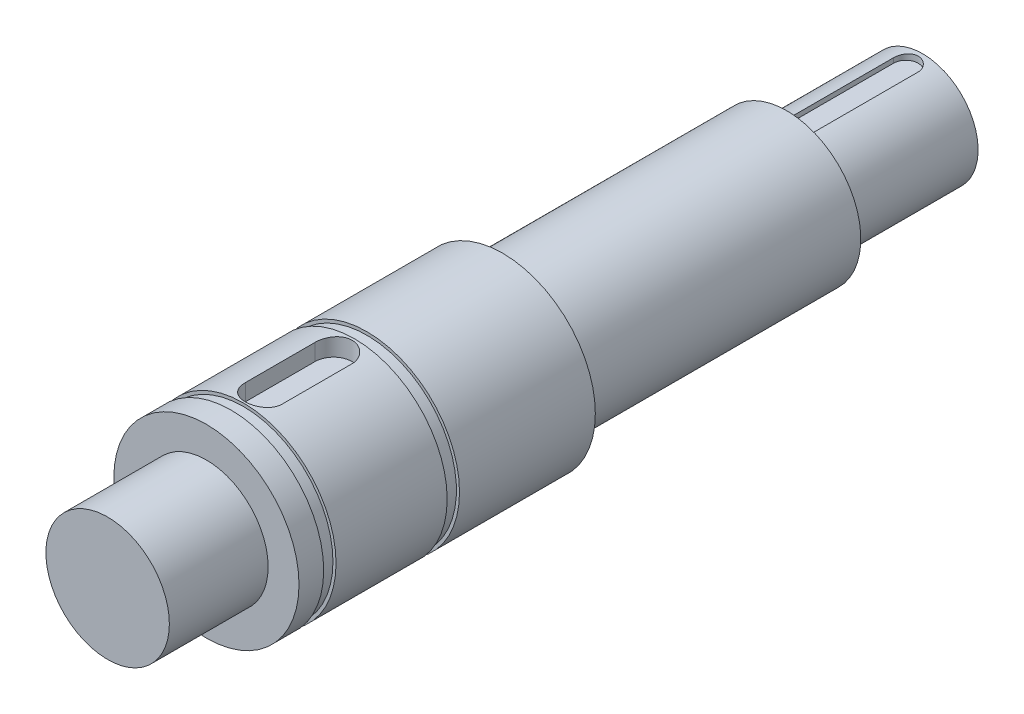
ISO-10303-21;
HEADER;
FILE_DESCRIPTION(('STEP AP214'),'2;1');
FILE_NAME('part.step','',(''),(''),'','','');
FILE_SCHEMA(('AUTOMOTIVE_DESIGN { 1 0 10303 214 1 1 1 1 }'));
ENDSEC;
DATA;
#1=APPLICATION_CONTEXT('core data for automotive mechanical design processes');
#2=APPLICATION_PROTOCOL_DEFINITION('international standard','automotive_design',2000,#1);
#3=PRODUCT_CONTEXT('',#1,'mechanical');
#4=PRODUCT('Part','Part','',(#3));
#5=PRODUCT_RELATED_PRODUCT_CATEGORY('part','',(#4));
#6=PRODUCT_DEFINITION_FORMATION('','',#4);
#7=PRODUCT_DEFINITION_CONTEXT('part definition',#1,'design');
#8=PRODUCT_DEFINITION('design','',#6,#7);
#9=PRODUCT_DEFINITION_SHAPE('','',#8);
#10=(LENGTH_UNIT() NAMED_UNIT(*) SI_UNIT(.MILLI.,.METRE.));
#11=(NAMED_UNIT(*) PLANE_ANGLE_UNIT() SI_UNIT($,.RADIAN.));
#12=(NAMED_UNIT(*) SI_UNIT($,.STERADIAN.) SOLID_ANGLE_UNIT());
#13=UNCERTAINTY_MEASURE_WITH_UNIT(LENGTH_MEASURE(1.E-05),#10,'distance_accuracy_value','');
#14=(GEOMETRIC_REPRESENTATION_CONTEXT(3) GLOBAL_UNCERTAINTY_ASSIGNED_CONTEXT((#13)) GLOBAL_UNIT_ASSIGNED_CONTEXT((#10,
#11,#12)) REPRESENTATION_CONTEXT('',''));
#15=CARTESIAN_POINT('',(0.,0.,0.));
#16=DIRECTION('',(0.,0.,1.));
#17=DIRECTION('',(1.,0.,0.));
#18=AXIS2_PLACEMENT_3D('',#15,#16,#17);
#19=CARTESIAN_POINT('',(0.,0.,-58.));
#20=DIRECTION('',(0.,0.,1.));
#21=DIRECTION('',(1.,0.,0.));
#22=AXIS2_PLACEMENT_3D('',#19,#20,#21);
#23=CYLINDRICAL_SURFACE('',#22,4.5);
#24=CARTESIAN_POINT('',(0.,0.,-47.));
#25=DIRECTION('',(0.,0.,-1.));
#26=DIRECTION('',(-1.,0.,0.));
#27=AXIS2_PLACEMENT_3D('',#24,#25,#26);
#28=CIRCLE('',#27,4.5);
#29=CARTESIAN_POINT('',(-4.5,0.,-47.));
#30=VERTEX_POINT('',#29);
#31=EDGE_CURVE('E168',#30,#30,#28,.T.);
#32=ORIENTED_EDGE('',*,*,#31,.T.);
#33=EDGE_LOOP('',(#32));
#34=FACE_BOUND('',#33,.T.);
#35=CARTESIAN_POINT('',(0.,0.,-58.));
#36=DIRECTION('',(0.,0.,-1.));
#37=DIRECTION('',(-1.,0.,0.));
#38=AXIS2_PLACEMENT_3D('',#35,#36,#37);
#39=CIRCLE('',#38,4.5);
#40=CARTESIAN_POINT('',(-4.5,0.,-58.));
#41=VERTEX_POINT('',#40);
#42=EDGE_CURVE('E169',#41,#41,#39,.T.);
#43=ORIENTED_EDGE('',*,*,#42,.F.);
#44=EDGE_LOOP('',(#43));
#45=FACE_BOUND('',#44,.T.);
#46=CARTESIAN_POINT('',(-1.,4.38748219369606,-48.15));
#47=CARTESIAN_POINT('',(-1.00000022729756,4.38748057820017,-48.1222374267632));
#48=CARTESIAN_POINT('',(-0.998843124720514,4.38774603792456,-48.0944885076275));
#49=CARTESIAN_POINT('',(-0.99422968705631,4.38879432652499,-48.0391962291098));
#50=CARTESIAN_POINT('',(-0.990773678717657,4.38957708187657,-48.0116528410778));
#51=CARTESIAN_POINT('',(-0.977003810088016,4.39267087860999,-47.9297284679647));
#52=CARTESIAN_POINT('',(-0.963287918104315,4.39572762287051,-47.8759073176507));
#53=CARTESIAN_POINT('',(-0.927214454041531,4.40347693098967,-47.77140532904));
#54=CARTESIAN_POINT('',(-0.904856659920317,4.40816953687928,-47.7207245714702));
#55=CARTESIAN_POINT('',(-0.852155803282729,4.41865929364095,-47.6238136533554));
#56=CARTESIAN_POINT('',(-0.821811362459797,4.42445663511658,-47.5775842628938));
#57=CARTESIAN_POINT('',(-0.753441836232103,4.43661426749371,-47.4901097244178));
#58=CARTESIAN_POINT('',(-0.715304798206198,4.44298190226389,-47.4489531224835));
#59=CARTESIAN_POINT('',(-0.632670298583493,4.45549904324729,-47.3735614669263));
#60=CARTESIAN_POINT('',(-0.588171842200236,4.46164851515653,-47.339327497877));
#61=CARTESIAN_POINT('',(-0.493480718999464,4.4731166145963,-47.2784037682988));
#62=CARTESIAN_POINT('',(-0.443231466972286,4.47842549507079,-47.2517999652732));
#63=CARTESIAN_POINT('',(-0.3388403259969,4.48753032196369,-47.2074491795047));
#64=CARTESIAN_POINT('',(-0.284699093445023,4.49132652279754,-47.1897007072694));
#65=CARTESIAN_POINT('',(-0.174986021353863,4.49692639035223,-47.1638434270851));
#66=CARTESIAN_POINT('',(-0.119451384668941,4.49876123301171,-47.1555836324999));
#67=CARTESIAN_POINT('',(-0.00775511274977182,4.50033975027167,-47.1484658402696));
#68=CARTESIAN_POINT('',(0.0484064623138786,4.50008362385938,-47.149606947987));
#69=CARTESIAN_POINT('',(0.158718181022166,4.49753274170445,-47.1611468829189));
#70=CARTESIAN_POINT('',(0.212886328087554,4.49527387966133,-47.1713827182866));
#71=CARTESIAN_POINT('',(0.318715838159109,4.48901235449708,-47.2005614897614));
#72=CARTESIAN_POINT('',(0.370377105463963,4.48500962486109,-47.2195047579901));
#73=CARTESIAN_POINT('',(0.47017759722058,4.4756526258873,-47.2657038028141));
#74=CARTESIAN_POINT('',(0.518287379800331,4.47028840892171,-47.2930210829071));
#75=CARTESIAN_POINT('',(0.609297798291436,4.45879618403283,-47.3551460967624));
#76=CARTESIAN_POINT('',(0.6521978506051,4.4526680906951,-47.389954668496));
#77=CARTESIAN_POINT('',(0.732537514994336,4.44016659933762,-47.4669551250524));
#78=CARTESIAN_POINT('',(0.769840928924182,4.43379075752742,-47.5092888279695));
#79=CARTESIAN_POINT('',(0.836854255104539,4.42163303741232,-47.5996903555232));
#80=CARTESIAN_POINT('',(0.866562088463182,4.41585132197676,-47.6477597447345));
#81=CARTESIAN_POINT('',(0.91760572203866,4.40552868647316,-47.7485006469476));
#82=CARTESIAN_POINT('',(0.938910270762524,4.40099241682023,-47.8011884646172));
#83=CARTESIAN_POINT('',(0.972293085974258,4.39373905796516,-47.9094884021323));
#84=CARTESIAN_POINT('',(0.984385094390385,4.39101925996541,-47.965096033648));
#85=CARTESIAN_POINT('',(0.994454316918768,4.38874305217374,-48.0426368683371));
#86=CARTESIAN_POINT('',(0.996534530294847,4.38827083327373,-48.0640724361361));
#87=CARTESIAN_POINT('',(0.999305697460971,4.38764061776731,-48.1070020407818));
#88=CARTESIAN_POINT('',(0.99999895320797,4.38748210050975,-48.1284959213596));
#89=CARTESIAN_POINT('',(1.,4.38748219369606,-48.15));
#90=B_SPLINE_CURVE_WITH_KNOTS('',3,(#46,#47,#48,#49,#50,#51,#52,#53,#54,#55,#56,#57,#58,#59,#60,
#61,#62,#63,#64,#65,#66,#67,#68,#69,#70,#71,#72,#73,#74,#75,#76,#77,#78,#79,#80,#81,#82,#83,#84,
#85,#86,#87,#88,#89),.UNSPECIFIED.,.F.,.F.,(4,2,2,2,2,2,2,2,2,2,2,2,2,2,2,2,2,2,2,2,2,4),(0.,
0.0832354312787237,0.166459034650705,0.332474058250131,0.498493347667377,0.66454130689973,
0.833167762015409,1.00182061551777,1.17230483262337,1.34276036411496,1.51046425594233,
1.67815218840286,1.8428941784505,2.00764245266122,2.17363096141649,2.33963804720395,
2.50919081696053,2.67878994333886,2.84901398606641,3.01898361347144,3.0835710727078,
3.14805124582347),.UNSPECIFIED.);
#91=CARTESIAN_POINT('',(-1.,4.38748219369606,-48.15));
#92=VERTEX_POINT('',#91);
#93=CARTESIAN_POINT('',(1.,4.38748219369606,-48.15));
#94=VERTEX_POINT('',#93);
#95=EDGE_CURVE('E13',#92,#94,#90,.T.);
#96=ORIENTED_EDGE('',*,*,#95,.F.);
#97=DIRECTION('',(0.,0.,1.));
#98=VECTOR('',#97,1.);
#99=CARTESIAN_POINT('',(-1.,4.38748219369606,-58.));
#100=LINE('',#99,#98);
#101=CARTESIAN_POINT('',(-1.,4.38748219369606,-56.65));
#102=VERTEX_POINT('',#101);
#103=EDGE_CURVE('E254',#102,#92,#100,.T.);
#104=ORIENTED_EDGE('',*,*,#103,.F.);
#105=CARTESIAN_POINT('',(1.,4.38748219369606,-56.65));
#106=CARTESIAN_POINT('',(1.00000022729756,4.38748057820017,-56.6777625732368));
#107=CARTESIAN_POINT('',(0.998843124720514,4.38774603792456,-56.7055114923726));
#108=CARTESIAN_POINT('',(0.994229687056312,4.38879432652499,-56.7608037708903));
#109=CARTESIAN_POINT('',(0.990773678717658,4.38957708187657,-56.7883471589223));
#110=CARTESIAN_POINT('',(0.977003810088017,4.39267087860999,-56.8702715320353));
#111=CARTESIAN_POINT('',(0.963287918104316,4.39572762287051,-56.9240926823493));
#112=CARTESIAN_POINT('',(0.927214454041531,4.40347693098967,-57.02859467096));
#113=CARTESIAN_POINT('',(0.904856659920317,4.40816953687928,-57.0792754285298));
#114=CARTESIAN_POINT('',(0.852155803282729,4.41865929364095,-57.1761863466447));
#115=CARTESIAN_POINT('',(0.821811362459796,4.42445663511658,-57.2224157371063));
#116=CARTESIAN_POINT('',(0.753441836232102,4.43661426749371,-57.3098902755822));
#117=CARTESIAN_POINT('',(0.715304798206196,4.44298190226389,-57.3510468775165));
#118=CARTESIAN_POINT('',(0.632670298583492,4.45549904324729,-57.4264385330737));
#119=CARTESIAN_POINT('',(0.588171842200236,4.46164851515653,-57.4606725021231));
#120=CARTESIAN_POINT('',(0.493480718999464,4.4731166145963,-57.5215962317012));
#121=CARTESIAN_POINT('',(0.443231466972284,4.47842549507079,-57.5482000347268));
#122=CARTESIAN_POINT('',(0.338840325996897,4.48753032196369,-57.5925508204954));
#123=CARTESIAN_POINT('',(0.284699093445021,4.49132652279754,-57.6102992927306));
#124=CARTESIAN_POINT('',(0.174986021353862,4.49692639035223,-57.6361565729149));
#125=CARTESIAN_POINT('',(0.119451384668941,4.49876123301171,-57.6444163675001));
#126=CARTESIAN_POINT('',(0.00775511274977149,4.50033975027167,-57.6515341597305));
#127=CARTESIAN_POINT('',(-0.0484064623138786,4.50008362385938,-57.650393052013));
#128=CARTESIAN_POINT('',(-0.158718181022166,4.49753274170445,-57.6388531170812));
#129=CARTESIAN_POINT('',(-0.212886328087554,4.49527387966133,-57.6286172817134));
#130=CARTESIAN_POINT('',(-0.318715838159108,4.48901235449708,-57.5994385102386));
#131=CARTESIAN_POINT('',(-0.370377105463962,4.48500962486109,-57.5804952420099));
#132=CARTESIAN_POINT('',(-0.470177597220579,4.4756526258873,-57.5342961971859));
#133=CARTESIAN_POINT('',(-0.518287379800332,4.47028840892171,-57.5069789170929));
#134=CARTESIAN_POINT('',(-0.609297798291437,4.45879618403283,-57.4448539032376));
#135=CARTESIAN_POINT('',(-0.6521978506051,4.4526680906951,-57.4100453315041));
#136=CARTESIAN_POINT('',(-0.732537514994335,4.44016659933762,-57.3330448749477));
#137=CARTESIAN_POINT('',(-0.769840928924182,4.43379075752742,-57.2907111720306));
#138=CARTESIAN_POINT('',(-0.836854255104539,4.42163303741232,-57.2003096444768));
#139=CARTESIAN_POINT('',(-0.866562088463183,4.41585132197676,-57.1522402552655));
#140=CARTESIAN_POINT('',(-0.917605722038659,4.40552868647316,-57.0514993530524));
#141=CARTESIAN_POINT('',(-0.938910270762523,4.40099241682023,-56.9988115353829));
#142=CARTESIAN_POINT('',(-0.972293085974257,4.39373905796516,-56.8905115978677));
#143=CARTESIAN_POINT('',(-0.984385094390385,4.39101925996541,-56.834903966352));
#144=CARTESIAN_POINT('',(-0.994454316918768,4.38874305217374,-56.7573631316629));
#145=CARTESIAN_POINT('',(-0.996534530294848,4.38827083327373,-56.7359275638639));
#146=CARTESIAN_POINT('',(-0.999305697460971,4.38764061776731,-56.6929979592183));
#147=CARTESIAN_POINT('',(-0.99999895320797,4.38748210050975,-56.6715040786404));
#148=CARTESIAN_POINT('',(-1.,4.38748219369606,-56.65));
#149=B_SPLINE_CURVE_WITH_KNOTS('',3,(#105,#106,#107,#108,#109,#110,#111,#112,#113,#114,#115,
#116,#117,#118,#119,#120,#121,#122,#123,#124,#125,#126,#127,#128,#129,#130,#131,#132,#133,#134,
#135,#136,#137,#138,#139,#140,#141,#142,#143,#144,#145,#146,#147,#148),.UNSPECIFIED.,.F.,.F.,(4,
2,2,2,2,2,2,2,2,2,2,2,2,2,2,2,2,2,2,2,2,4),(0.,0.0832354312787167,0.166459034650698,
0.332474058250131,0.498493347667377,0.66454130689973,0.833167762015416,1.00182061551778,
1.17230483262337,1.34276036411497,1.51046425594233,1.67815218840286,1.8428941784505,
2.00764245266123,2.17363096141649,2.33963804720395,2.50919081696053,2.67878994333886,
2.8490139860664,3.01898361347144,3.08357107270781,3.14805124582347),.UNSPECIFIED.);
#150=CARTESIAN_POINT('',(1.,4.38748219369606,-56.65));
#151=VERTEX_POINT('',#150);
#152=EDGE_CURVE('E256',#151,#102,#149,.T.);
#153=ORIENTED_EDGE('',*,*,#152,.F.);
#154=DIRECTION('',(0.,0.,1.));
#155=VECTOR('',#154,1.);
#156=CARTESIAN_POINT('',(1.,4.38748219369606,-58.));
#157=LINE('',#156,#155);
#158=EDGE_CURVE('E57',#94,#151,#157,.F.);
#159=ORIENTED_EDGE('',*,*,#158,.F.);
#160=EDGE_LOOP('',(#96,#104,#153,#159));
#161=FACE_BOUND('',#160,.T.);
#162=ADVANCED_FACE('F44',(#34,#45,#161),#23,.T.);
#163=CARTESIAN_POINT('',(0.,0.,-12.));
#164=DIRECTION('',(0.,0.,1.));
#165=DIRECTION('',(1.,0.,0.));
#166=AXIS2_PLACEMENT_3D('',#163,#164,#165);
#167=CYLINDRICAL_SURFACE('',#166,7.5);
#168=CARTESIAN_POINT('',(0.,0.,-3.));
#169=DIRECTION('',(0.,0.,-1.));
#170=DIRECTION('',(-1.,0.,0.));
#171=AXIS2_PLACEMENT_3D('',#168,#169,#170);
#172=CIRCLE('',#171,7.5);
#173=CARTESIAN_POINT('',(-7.5,0.,-3.));
#174=VERTEX_POINT('',#173);
#175=EDGE_CURVE('E190',#174,#174,#172,.T.);
#176=ORIENTED_EDGE('',*,*,#175,.T.);
#177=EDGE_LOOP('',(#176));
#178=FACE_BOUND('',#177,.T.);
#179=CARTESIAN_POINT('',(0.,0.,-12.));
#180=DIRECTION('',(0.,0.,-1.));
#181=DIRECTION('',(-1.,0.,0.));
#182=AXIS2_PLACEMENT_3D('',#179,#180,#181);
#183=CIRCLE('',#182,7.5);
#184=CARTESIAN_POINT('',(-7.5,0.,-12.));
#185=VERTEX_POINT('',#184);
#186=EDGE_CURVE('E193',#185,#185,#183,.T.);
#187=ORIENTED_EDGE('',*,*,#186,.F.);
#188=EDGE_LOOP('',(#187));
#189=FACE_BOUND('',#188,.T.);
#190=CARTESIAN_POINT('',(-1.5,7.34846922834953,-4.65));
#191=CARTESIAN_POINT('',(-1.50000022281785,7.34846708368379,-4.60824964702598));
#192=CARTESIAN_POINT('',(-1.49825580304231,7.34882548849073,-4.56651972089631));
#193=CARTESIAN_POINT('',(-1.49129990121868,7.35024103612599,-4.48336692324935));
#194=CARTESIAN_POINT('',(-1.48608884806514,7.35129809251648,-4.44194401438861));
#195=CARTESIAN_POINT('',(-1.46532179966178,7.35547712463863,-4.31871758977383));
#196=CARTESIAN_POINT('',(-1.44463166473169,7.35960717568916,-4.23775285684914));
#197=CARTESIAN_POINT('',(-1.39019521531979,7.3700824530126,-4.08053610488708));
#198=CARTESIAN_POINT('',(-1.35644745956443,7.37642792381148,-4.0042846071649));
#199=CARTESIAN_POINT('',(-1.27688115661478,7.39061580193243,-3.8585026741802));
#200=CARTESIAN_POINT('',(-1.23106135835596,7.3984583643797,-3.78897293653671));
#201=CARTESIAN_POINT('',(-1.12797076401964,7.41487912836228,-3.65766024497245));
#202=CARTESIAN_POINT('',(-1.07056335273245,7.42346533332123,-3.59598557665593));
#203=CARTESIAN_POINT('',(-0.94621588648777,7.44033638421269,-3.48306834106866));
#204=CARTESIAN_POINT('',(-0.879274357262517,7.44862118328939,-3.43182739015428));
#205=CARTESIAN_POINT('',(-0.737040080100442,7.46404215641311,-3.34081664861441));
#206=CARTESIAN_POINT('',(-0.661679737162488,7.47116770923011,-3.30115054618155));
#207=CARTESIAN_POINT('',(-0.505201803163347,7.48337633181746,-3.23508617317534));
#208=CARTESIAN_POINT('',(-0.424085065723369,7.48845970368315,-3.20868594006614));
#209=CARTESIAN_POINT('',(-0.259526113330651,7.49595476665488,-3.17023942729661));
#210=CARTESIAN_POINT('',(-0.176128551863995,7.49840073782307,-3.15800881577416));
#211=CARTESIAN_POINT('',(-0.00842981512369662,7.50046382619179,-3.1476735308424));
#212=CARTESIAN_POINT('',(0.075871293587885,7.50008115036074,-3.14956782393235));
#213=CARTESIAN_POINT('',(0.241713304135038,7.49655651665733,-3.1672893005574));
#214=CARTESIAN_POINT('',(0.323276420035845,7.49345395247565,-3.18291757485716));
#215=CARTESIAN_POINT('',(0.482598009831126,7.48488261752637,-3.22734776546407));
#216=CARTESIAN_POINT('',(0.56035635921191,7.47941376937801,-3.25615011258337));
#217=CARTESIAN_POINT('',(0.710430406969439,7.46665933680788,-3.32629560524302));
#218=CARTESIAN_POINT('',(0.782708590224708,7.45936248586644,-3.36771688038894));
#219=CARTESIAN_POINT('',(0.919359656824591,7.44375677443759,-3.46186540541502));
#220=CARTESIAN_POINT('',(0.983731884330271,7.43544783010564,-3.51459359226563));
#221=CARTESIAN_POINT('',(1.10391930980786,7.41856556052757,-3.63094254243784));
#222=CARTESIAN_POINT('',(1.15956704249406,7.4099901486261,-3.69473610310735));
#223=CARTESIAN_POINT('',(1.25941634984917,7.39367559174636,-3.83085713773333));
#224=CARTESIAN_POINT('',(1.3036147536323,7.38593667878111,-3.90318696774937));
#225=CARTESIAN_POINT('',(1.37936993196715,7.37216595063482,-4.05457860741887));
#226=CARTESIAN_POINT('',(1.41089231495175,7.36613879247518,-4.13365803509486));
#227=CARTESIAN_POINT('',(1.46011064599487,7.3565424159374,-4.29608794688353));
#228=CARTESIAN_POINT('',(1.47782719122649,7.35296953692431,-4.3794318699722));
#229=CARTESIAN_POINT('',(1.49224940718295,7.35004765787944,-4.49453522526966));
#230=CARTESIAN_POINT('',(1.49515688348327,7.34945639807989,-4.52558120967366));
#231=CARTESIAN_POINT('',(1.49902974699698,7.34866751080158,-4.58774679620614));
#232=CARTESIAN_POINT('',(1.49999838435698,7.34846922457237,-4.61886618743369));
#233=CARTESIAN_POINT('',(1.5,7.34846922834953,-4.65));
#234=B_SPLINE_CURVE_WITH_KNOTS('',3,(#190,#191,#192,#193,#194,#195,#196,#197,#198,#199,#200,
#201,#202,#203,#204,#205,#206,#207,#208,#209,#210,#211,#212,#213,#214,#215,#216,#217,#218,#219,
#220,#221,#222,#223,#224,#225,#226,#227,#228,#229,#230,#231,#232,#233),.UNSPECIFIED.,.F.,.F.,(4,
2,2,2,2,2,2,2,2,2,2,2,2,2,2,2,2,2,2,2,2,4),(0.,0.125172765536881,0.250330047482302,
0.500041950777919,0.749781424630607,0.999546789973977,1.25244966698579,1.50539169310193,
1.76053453316395,2.01563961659759,2.2673874055418,2.51911677461147,2.76725934416578,
3.0154100289384,3.26512947834264,3.51486962926355,3.76893405246969,4.02306876364244,
4.27788839474046,4.53232712418828,4.62584100815663,4.71919799965423),.UNSPECIFIED.);
#235=CARTESIAN_POINT('',(-1.5,7.34846922834953,-4.65));
#236=VERTEX_POINT('',#235);
#237=CARTESIAN_POINT('',(1.5,7.34846922834953,-4.65));
#238=VERTEX_POINT('',#237);
#239=EDGE_CURVE('E249',#236,#238,#234,.T.);
#240=ORIENTED_EDGE('',*,*,#239,.F.);
#241=DIRECTION('',(0.,0.,1.));
#242=VECTOR('',#241,1.);
#243=CARTESIAN_POINT('',(-1.5,7.34846922834953,-12.));
#244=LINE('',#243,#242);
#245=CARTESIAN_POINT('',(-1.5,7.34846922834953,-10.3));
#246=VERTEX_POINT('',#245);
#247=EDGE_CURVE('E216',#246,#236,#244,.T.);
#248=ORIENTED_EDGE('',*,*,#247,.F.);
#249=CARTESIAN_POINT('',(1.5,7.34846922834953,-10.3));
#250=CARTESIAN_POINT('',(1.50000022281785,7.34846708368379,-10.341750352974));
#251=CARTESIAN_POINT('',(1.49825580304231,7.34882548849073,-10.3834802791037));
#252=CARTESIAN_POINT('',(1.49129990121868,7.35024103612599,-10.4666330767507));
#253=CARTESIAN_POINT('',(1.48608884806514,7.35129809251648,-10.5080559856114));
#254=CARTESIAN_POINT('',(1.46532179966177,7.35547712463863,-10.6312824102262));
#255=CARTESIAN_POINT('',(1.44463166473169,7.35960717568916,-10.7122471431509));
#256=CARTESIAN_POINT('',(1.39019521531979,7.3700824530126,-10.8694638951129));
#257=CARTESIAN_POINT('',(1.35644745956443,7.37642792381148,-10.9457153928351));
#258=CARTESIAN_POINT('',(1.27688115661478,7.39061580193243,-11.0914973258198));
#259=CARTESIAN_POINT('',(1.23106135835596,7.3984583643797,-11.1610270634633));
#260=CARTESIAN_POINT('',(1.12797076401964,7.41487912836228,-11.2923397550276));
#261=CARTESIAN_POINT('',(1.07056335273245,7.42346533332123,-11.3540144233441));
#262=CARTESIAN_POINT('',(0.946215886487769,7.44033638421269,-11.4669316589313));
#263=CARTESIAN_POINT('',(0.879274357262516,7.44862118328939,-11.5181726098457));
#264=CARTESIAN_POINT('',(0.737040080100442,7.46404215641311,-11.6091833513856));
#265=CARTESIAN_POINT('',(0.661679737162488,7.47116770923011,-11.6488494538185));
#266=CARTESIAN_POINT('',(0.505201803163347,7.48337633181746,-11.7149138268247));
#267=CARTESIAN_POINT('',(0.424085065723369,7.48845970368315,-11.7413140599339));
#268=CARTESIAN_POINT('',(0.259526113330651,7.49595476665488,-11.7797605727034));
#269=CARTESIAN_POINT('',(0.176128551863995,7.49840073782307,-11.7919911842258));
#270=CARTESIAN_POINT('',(0.00842981512369644,7.50046382619179,-11.8023264691576));
#271=CARTESIAN_POINT('',(-0.0758712935878853,7.50008115036074,-11.8004321760677));
#272=CARTESIAN_POINT('',(-0.241713304135038,7.49655651665733,-11.7827106994426));
#273=CARTESIAN_POINT('',(-0.323276420035845,7.49345395247565,-11.7670824251428));
#274=CARTESIAN_POINT('',(-0.482598009831126,7.48488261752637,-11.7226522345359));
#275=CARTESIAN_POINT('',(-0.56035635921191,7.47941376937801,-11.6938498874166));
#276=CARTESIAN_POINT('',(-0.71043040696944,7.46665933680788,-11.623704394757));
#277=CARTESIAN_POINT('',(-0.782708590224709,7.45936248586644,-11.5822831196111));
#278=CARTESIAN_POINT('',(-0.919359656824591,7.44375677443759,-11.488134594585));
#279=CARTESIAN_POINT('',(-0.983731884330272,7.43544783010564,-11.4354064077344));
#280=CARTESIAN_POINT('',(-1.10391930980786,7.41856556052757,-11.3190574575622));
#281=CARTESIAN_POINT('',(-1.15956704249406,7.4099901486261,-11.2552638968927));
#282=CARTESIAN_POINT('',(-1.25941634984917,7.39367559174636,-11.1191428622667));
#283=CARTESIAN_POINT('',(-1.3036147536323,7.38593667878111,-11.0468130322506));
#284=CARTESIAN_POINT('',(-1.37936993196715,7.37216595063482,-10.8954213925811));
#285=CARTESIAN_POINT('',(-1.41089231495175,7.36613879247518,-10.8163419649051));
#286=CARTESIAN_POINT('',(-1.46011064599487,7.3565424159374,-10.6539120531165));
#287=CARTESIAN_POINT('',(-1.47782719122649,7.35296953692431,-10.5705681300278));
#288=CARTESIAN_POINT('',(-1.49224940718295,7.35004765787944,-10.4554647747303));
#289=CARTESIAN_POINT('',(-1.49515688348327,7.34945639807989,-10.4244187903263));
#290=CARTESIAN_POINT('',(-1.49902974699698,7.34866751080158,-10.3622532037939));
#291=CARTESIAN_POINT('',(-1.49999838435698,7.34846922457237,-10.3311338125663));
#292=CARTESIAN_POINT('',(-1.5,7.34846922834953,-10.3));
#293=B_SPLINE_CURVE_WITH_KNOTS('',3,(#249,#250,#251,#252,#253,#254,#255,#256,#257,#258,#259,
#260,#261,#262,#263,#264,#265,#266,#267,#268,#269,#270,#271,#272,#273,#274,#275,#276,#277,#278,
#279,#280,#281,#282,#283,#284,#285,#286,#287,#288,#289,#290,#291,#292),.UNSPECIFIED.,.F.,.F.,(4,
2,2,2,2,2,2,2,2,2,2,2,2,2,2,2,2,2,2,2,2,4),(0.,0.12517276553688,0.250330047482302,
0.50004195077792,0.749781424630607,0.999546789973978,1.25244966698579,1.50539169310193,
1.76053453316395,2.01563961659759,2.2673874055418,2.51911677461147,2.76725934416578,
3.0154100289384,3.26512947834264,3.51486962926355,3.76893405246969,4.02306876364245,
4.27788839474046,4.53232712418828,4.62584100815663,4.71919799965423),.UNSPECIFIED.);
#294=CARTESIAN_POINT('',(1.5,7.34846922834953,-10.3));
#295=VERTEX_POINT('',#294);
#296=EDGE_CURVE('E218',#295,#246,#293,.T.);
#297=ORIENTED_EDGE('',*,*,#296,.F.);
#298=DIRECTION('',(0.,0.,1.));
#299=VECTOR('',#298,1.);
#300=CARTESIAN_POINT('',(1.5,7.34846922834953,-12.));
#301=LINE('',#300,#299);
#302=EDGE_CURVE('E225',#238,#295,#301,.F.);
#303=ORIENTED_EDGE('',*,*,#302,.F.);
#304=EDGE_LOOP('',(#240,#248,#297,#303));
#305=FACE_BOUND('',#304,.T.);
#306=ADVANCED_FACE('F227',(#178,#189,#305),#167,.T.);
#307=CARTESIAN_POINT('',(0.,0.,8.));
#308=DIRECTION('',(0.,0.,-1.));
#309=DIRECTION('',(-1.,0.,0.));
#310=AXIS2_PLACEMENT_3D('',#307,#308,#309);
#311=CYLINDRICAL_SURFACE('',#310,5.);
#312=CARTESIAN_POINT('',(0.,0.,8.));
#313=DIRECTION('',(0.,0.,1.));
#314=DIRECTION('',(1.,0.,0.));
#315=AXIS2_PLACEMENT_3D('',#312,#313,#314);
#316=CIRCLE('',#315,5.);
#317=CARTESIAN_POINT('',(5.,0.,8.));
#318=VERTEX_POINT('',#317);
#319=EDGE_CURVE('E210',#318,#318,#316,.T.);
#320=ORIENTED_EDGE('',*,*,#319,.F.);
#321=EDGE_LOOP('',(#320));
#322=FACE_BOUND('',#321,.T.);
#323=CARTESIAN_POINT('',(0.,0.,0.));
#324=DIRECTION('',(0.,0.,1.));
#325=DIRECTION('',(1.,0.,0.));
#326=AXIS2_PLACEMENT_3D('',#323,#324,#325);
#327=CIRCLE('',#326,5.);
#328=CARTESIAN_POINT('',(5.,0.,0.));
#329=VERTEX_POINT('',#328);
#330=EDGE_CURVE('E205',#329,#329,#327,.T.);
#331=ORIENTED_EDGE('',*,*,#330,.T.);
#332=EDGE_LOOP('',(#331));
#333=FACE_BOUND('',#332,.T.);
#334=ADVANCED_FACE('F46',(#322,#333),#311,.T.);
#335=CARTESIAN_POINT('',(0.,0.,8.));
#336=DIRECTION('',(0.,0.,1.));
#337=DIRECTION('',(1.,0.,0.));
#338=AXIS2_PLACEMENT_3D('',#335,#336,#337);
#339=PLANE('',#338);
#340=ORIENTED_EDGE('',*,*,#319,.T.);
#341=EDGE_LOOP('',(#340));
#342=FACE_BOUND('',#341,.T.);
#343=ADVANCED_FACE('F385',(#342),#339,.T.);
#344=CARTESIAN_POINT('',(0.,0.,-2.));
#345=DIRECTION('',(0.,0.,1.));
#346=DIRECTION('',(1.,0.,0.));
#347=AXIS2_PLACEMENT_3D('',#344,#345,#346);
#348=CYLINDRICAL_SURFACE('',#347,7.5);
#349=CARTESIAN_POINT('',(0.,0.,-2.));
#350=DIRECTION('',(0.,0.,1.));
#351=DIRECTION('',(1.,0.,0.));
#352=AXIS2_PLACEMENT_3D('',#349,#350,#351);
#353=CIRCLE('',#352,7.5);
#354=CARTESIAN_POINT('',(7.5,0.,-2.));
#355=VERTEX_POINT('',#354);
#356=EDGE_CURVE('E202',#355,#355,#353,.T.);
#357=ORIENTED_EDGE('',*,*,#356,.T.);
#358=EDGE_LOOP('',(#357));
#359=FACE_BOUND('',#358,.T.);
#360=CARTESIAN_POINT('',(0.,0.,0.));
#361=DIRECTION('',(0.,0.,1.));
#362=DIRECTION('',(1.,0.,0.));
#363=AXIS2_PLACEMENT_3D('',#360,#361,#362);
#364=CIRCLE('',#363,7.5);
#365=CARTESIAN_POINT('',(7.5,0.,0.));
#366=VERTEX_POINT('',#365);
#367=EDGE_CURVE('E201',#366,#366,#364,.T.);
#368=ORIENTED_EDGE('',*,*,#367,.F.);
#369=EDGE_LOOP('',(#368));
#370=FACE_BOUND('',#369,.T.);
#371=ADVANCED_FACE('F379',(#359,#370),#348,.T.);
#372=CARTESIAN_POINT('',(0.,0.,-2.));
#373=DIRECTION('',(0.,0.,1.));
#374=DIRECTION('',(1.,0.,0.));
#375=AXIS2_PLACEMENT_3D('',#372,#373,#374);
#376=PLANE('',#375);
#377=CARTESIAN_POINT('',(0.,0.,-2.));
#378=DIRECTION('',(0.,0.,1.));
#379=DIRECTION('',(1.,0.,0.));
#380=AXIS2_PLACEMENT_3D('',#377,#378,#379);
#381=CIRCLE('',#380,7.25);
#382=CARTESIAN_POINT('',(7.25,0.,-2.));
#383=VERTEX_POINT('',#382);
#384=EDGE_CURVE('E213',#383,#383,#381,.F.);
#385=ORIENTED_EDGE('',*,*,#384,.F.);
#386=EDGE_LOOP('',(#385));
#387=FACE_BOUND('',#386,.T.);
#388=ORIENTED_EDGE('',*,*,#356,.F.);
#389=EDGE_LOOP('',(#388));
#390=FACE_BOUND('',#389,.T.);
#391=ADVANCED_FACE('F376',(#387,#390),#376,.F.);
#392=CARTESIAN_POINT('',(0.,0.,0.));
#393=DIRECTION('',(0.,0.,1.));
#394=DIRECTION('',(1.,0.,0.));
#395=AXIS2_PLACEMENT_3D('',#392,#393,#394);
#396=PLANE('',#395);
#397=ORIENTED_EDGE('',*,*,#330,.F.);
#398=EDGE_LOOP('',(#397));
#399=FACE_BOUND('',#398,.T.);
#400=ORIENTED_EDGE('',*,*,#367,.T.);
#401=EDGE_LOOP('',(#400));
#402=FACE_BOUND('',#401,.T.);
#403=ADVANCED_FACE('F373',(#399,#402),#396,.T.);
#404=CARTESIAN_POINT('',(0.,0.,-3.));
#405=DIRECTION('',(0.,0.,1.));
#406=DIRECTION('',(1.,0.,0.));
#407=AXIS2_PLACEMENT_3D('',#404,#405,#406);
#408=CYLINDRICAL_SURFACE('',#407,7.25);
#409=CARTESIAN_POINT('',(0.,0.,-3.));
#410=DIRECTION('',(0.,0.,-1.));
#411=DIRECTION('',(-1.,0.,0.));
#412=AXIS2_PLACEMENT_3D('',#409,#410,#411);
#413=CIRCLE('',#412,7.25);
#414=CARTESIAN_POINT('',(-7.25,0.,-3.));
#415=VERTEX_POINT('',#414);
#416=EDGE_CURVE('E196',#415,#415,#413,.T.);
#417=ORIENTED_EDGE('',*,*,#416,.F.);
#418=EDGE_LOOP('',(#417));
#419=FACE_BOUND('',#418,.T.);
#420=ORIENTED_EDGE('',*,*,#384,.T.);
#421=EDGE_LOOP('',(#420));
#422=FACE_BOUND('',#421,.T.);
#423=ADVANCED_FACE('F347',(#419,#422),#408,.T.);
#424=CARTESIAN_POINT('',(0.,0.,-12.));
#425=DIRECTION('',(0.,0.,-1.));
#426=DIRECTION('',(-1.,0.,0.));
#427=AXIS2_PLACEMENT_3D('',#424,#425,#426);
#428=PLANE('',#427);
#429=CARTESIAN_POINT('',(0.,0.,-12.));
#430=DIRECTION('',(0.,0.,-1.));
#431=DIRECTION('',(-1.,0.,0.));
#432=AXIS2_PLACEMENT_3D('',#429,#430,#431);
#433=CIRCLE('',#432,7.25);
#434=CARTESIAN_POINT('',(-7.25,0.,-12.));
#435=VERTEX_POINT('',#434);
#436=EDGE_CURVE('E184',#435,#435,#433,.T.);
#437=ORIENTED_EDGE('',*,*,#436,.F.);
#438=EDGE_LOOP('',(#437));
#439=FACE_BOUND('',#438,.T.);
#440=ORIENTED_EDGE('',*,*,#186,.T.);
#441=EDGE_LOOP('',(#440));
#442=FACE_BOUND('',#441,.T.);
#443=ADVANCED_FACE('F345',(#439,#442),#428,.T.);
#444=CARTESIAN_POINT('',(0.,0.,-3.));
#445=DIRECTION('',(0.,0.,-1.));
#446=DIRECTION('',(-1.,0.,0.));
#447=AXIS2_PLACEMENT_3D('',#444,#445,#446);
#448=PLANE('',#447);
#449=ORIENTED_EDGE('',*,*,#416,.T.);
#450=EDGE_LOOP('',(#449));
#451=FACE_BOUND('',#450,.T.);
#452=ORIENTED_EDGE('',*,*,#175,.F.);
#453=EDGE_LOOP('',(#452));
#454=FACE_BOUND('',#453,.T.);
#455=ADVANCED_FACE('F343',(#451,#454),#448,.F.);
#456=CARTESIAN_POINT('',(0.,0.,-13.));
#457=DIRECTION('',(0.,0.,1.));
#458=DIRECTION('',(1.,0.,0.));
#459=AXIS2_PLACEMENT_3D('',#456,#457,#458);
#460=CYLINDRICAL_SURFACE('',#459,7.25);
#461=CARTESIAN_POINT('',(0.,0.,-13.));
#462=DIRECTION('',(0.,0.,-1.));
#463=DIRECTION('',(-1.,0.,0.));
#464=AXIS2_PLACEMENT_3D('',#461,#462,#463);
#465=CIRCLE('',#464,7.25);
#466=CARTESIAN_POINT('',(-7.25,0.,-13.));
#467=VERTEX_POINT('',#466);
#468=EDGE_CURVE('E187',#467,#467,#465,.T.);
#469=ORIENTED_EDGE('',*,*,#468,.F.);
#470=EDGE_LOOP('',(#469));
#471=FACE_BOUND('',#470,.T.);
#472=ORIENTED_EDGE('',*,*,#436,.T.);
#473=EDGE_LOOP('',(#472));
#474=FACE_BOUND('',#473,.T.);
#475=ADVANCED_FACE('F339',(#471,#474),#460,.T.);
#476=CARTESIAN_POINT('',(0.,0.,-24.));
#477=DIRECTION('',(0.,0.,1.));
#478=DIRECTION('',(1.,0.,0.));
#479=AXIS2_PLACEMENT_3D('',#476,#477,#478);
#480=CYLINDRICAL_SURFACE('',#479,7.5);
#481=CARTESIAN_POINT('',(0.,0.,-24.));
#482=DIRECTION('',(0.,0.,-1.));
#483=DIRECTION('',(-1.,0.,0.));
#484=AXIS2_PLACEMENT_3D('',#481,#482,#483);
#485=CIRCLE('',#484,7.5);
#486=CARTESIAN_POINT('',(-7.5,0.,-24.));
#487=VERTEX_POINT('',#486);
#488=EDGE_CURVE('E181',#487,#487,#485,.T.);
#489=ORIENTED_EDGE('',*,*,#488,.F.);
#490=EDGE_LOOP('',(#489));
#491=FACE_BOUND('',#490,.T.);
#492=CARTESIAN_POINT('',(0.,0.,-13.));
#493=DIRECTION('',(0.,0.,-1.));
#494=DIRECTION('',(-1.,0.,0.));
#495=AXIS2_PLACEMENT_3D('',#492,#493,#494);
#496=CIRCLE('',#495,7.5);
#497=CARTESIAN_POINT('',(-7.5,0.,-13.));
#498=VERTEX_POINT('',#497);
#499=EDGE_CURVE('E178',#498,#498,#496,.T.);
#500=ORIENTED_EDGE('',*,*,#499,.T.);
#501=EDGE_LOOP('',(#500));
#502=FACE_BOUND('',#501,.T.);
#503=ADVANCED_FACE('F332',(#491,#502),#480,.T.);
#504=CARTESIAN_POINT('',(0.,0.,-24.));
#505=DIRECTION('',(0.,0.,-1.));
#506=DIRECTION('',(-1.,0.,0.));
#507=AXIS2_PLACEMENT_3D('',#504,#505,#506);
#508=PLANE('',#507);
#509=CARTESIAN_POINT('',(0.,0.,-24.));
#510=DIRECTION('',(0.,0.,-1.));
#511=DIRECTION('',(-1.,0.,0.));
#512=AXIS2_PLACEMENT_3D('',#509,#510,#511);
#513=CIRCLE('',#512,6.);
#514=CARTESIAN_POINT('',(-6.,0.,-24.));
#515=VERTEX_POINT('',#514);
#516=EDGE_CURVE('E172',#515,#515,#513,.T.);
#517=ORIENTED_EDGE('',*,*,#516,.F.);
#518=EDGE_LOOP('',(#517));
#519=FACE_BOUND('',#518,.T.);
#520=ORIENTED_EDGE('',*,*,#488,.T.);
#521=EDGE_LOOP('',(#520));
#522=FACE_BOUND('',#521,.T.);
#523=ADVANCED_FACE('F329',(#519,#522),#508,.T.);
#524=CARTESIAN_POINT('',(0.,0.,-13.));
#525=DIRECTION('',(0.,0.,-1.));
#526=DIRECTION('',(-1.,0.,0.));
#527=AXIS2_PLACEMENT_3D('',#524,#525,#526);
#528=PLANE('',#527);
#529=ORIENTED_EDGE('',*,*,#468,.T.);
#530=EDGE_LOOP('',(#529));
#531=FACE_BOUND('',#530,.T.);
#532=ORIENTED_EDGE('',*,*,#499,.F.);
#533=EDGE_LOOP('',(#532));
#534=FACE_BOUND('',#533,.T.);
#535=ADVANCED_FACE('F324',(#531,#534),#528,.F.);
#536=CARTESIAN_POINT('',(0.,0.,-47.));
#537=DIRECTION('',(0.,0.,1.));
#538=DIRECTION('',(1.,0.,0.));
#539=AXIS2_PLACEMENT_3D('',#536,#537,#538);
#540=CYLINDRICAL_SURFACE('',#539,6.);
#541=CARTESIAN_POINT('',(0.,0.,-47.));
#542=DIRECTION('',(0.,0.,-1.));
#543=DIRECTION('',(-1.,0.,0.));
#544=AXIS2_PLACEMENT_3D('',#541,#542,#543);
#545=CIRCLE('',#544,6.);
#546=CARTESIAN_POINT('',(-6.,0.,-47.));
#547=VERTEX_POINT('',#546);
#548=EDGE_CURVE('E175',#547,#547,#545,.T.);
#549=ORIENTED_EDGE('',*,*,#548,.F.);
#550=EDGE_LOOP('',(#549));
#551=FACE_BOUND('',#550,.T.);
#552=ORIENTED_EDGE('',*,*,#516,.T.);
#553=EDGE_LOOP('',(#552));
#554=FACE_BOUND('',#553,.T.);
#555=ADVANCED_FACE('F319',(#551,#554),#540,.T.);
#556=CARTESIAN_POINT('',(0.,0.,-47.));
#557=DIRECTION('',(0.,0.,-1.));
#558=DIRECTION('',(-1.,0.,0.));
#559=AXIS2_PLACEMENT_3D('',#556,#557,#558);
#560=PLANE('',#559);
#561=ORIENTED_EDGE('',*,*,#31,.F.);
#562=EDGE_LOOP('',(#561));
#563=FACE_BOUND('',#562,.T.);
#564=ORIENTED_EDGE('',*,*,#548,.T.);
#565=EDGE_LOOP('',(#564));
#566=FACE_BOUND('',#565,.T.);
#567=ADVANCED_FACE('F315',(#563,#566),#560,.T.);
#568=CARTESIAN_POINT('',(0.,0.,-58.));
#569=DIRECTION('',(0.,0.,-1.));
#570=DIRECTION('',(-1.,0.,0.));
#571=AXIS2_PLACEMENT_3D('',#568,#569,#570);
#572=PLANE('',#571);
#573=CARTESIAN_POINT('',(0.,0.,-58.));
#574=DIRECTION('',(0.,0.,-1.));
#575=DIRECTION('',(-1.,0.,0.));
#576=AXIS2_PLACEMENT_3D('',#573,#574,#575);
#577=CIRCLE('',#576,2.25);
#578=CARTESIAN_POINT('',(-2.25,0.,-58.));
#579=VERTEX_POINT('',#578);
#580=EDGE_CURVE('E140',#579,#579,#577,.T.);
#581=ORIENTED_EDGE('',*,*,#580,.F.);
#582=EDGE_LOOP('',(#581));
#583=FACE_BOUND('',#582,.T.);
#584=ORIENTED_EDGE('',*,*,#42,.T.);
#585=EDGE_LOOP('',(#584));
#586=FACE_BOUND('',#585,.T.);
#587=ADVANCED_FACE('F247',(#583,#586),#572,.T.);
#588=CARTESIAN_POINT('',(0.,11.,-4.65));
#589=DIRECTION('',(0.,-1.,0.));
#590=DIRECTION('',(0.,0.,-1.));
#591=AXIS2_PLACEMENT_3D('',#588,#589,#590);
#592=CYLINDRICAL_SURFACE('',#591,1.5);
#593=ORIENTED_EDGE('',*,*,#239,.T.);
#594=DIRECTION('',(0.,-1.,0.));
#595=VECTOR('',#594,1.);
#596=CARTESIAN_POINT('',(1.5,11.,-4.65));
#597=LINE('',#596,#595);
#598=CARTESIAN_POINT('',(1.5,6.,-4.65));
#599=VERTEX_POINT('',#598);
#600=EDGE_CURVE('E166',#238,#599,#597,.T.);
#601=ORIENTED_EDGE('',*,*,#600,.T.);
#602=CARTESIAN_POINT('',(0.,6.,-4.65));
#603=DIRECTION('',(0.,1.,0.));
#604=DIRECTION('',(0.,0.,1.));
#605=AXIS2_PLACEMENT_3D('',#602,#603,#604);
#606=CIRCLE('',#605,1.5);
#607=CARTESIAN_POINT('',(-1.5,6.,-4.65));
#608=VERTEX_POINT('',#607);
#609=EDGE_CURVE('E122',#608,#599,#606,.T.);
#610=ORIENTED_EDGE('',*,*,#609,.F.);
#611=DIRECTION('',(0.,-1.,0.));
#612=VECTOR('',#611,1.);
#613=CARTESIAN_POINT('',(-1.5,11.,-4.65));
#614=LINE('',#613,#612);
#615=EDGE_CURVE('E161',#236,#608,#614,.T.);
#616=ORIENTED_EDGE('',*,*,#615,.F.);
#617=EDGE_LOOP('',(#593,#601,#610,#616));
#618=FACE_BOUND('',#617,.T.);
#619=ADVANCED_FACE('F242',(#618),#592,.F.);
#620=CARTESIAN_POINT('',(1.5,11.,-4.65));
#621=DIRECTION('',(-1.,0.,0.));
#622=DIRECTION('',(0.,0.,1.));
#623=AXIS2_PLACEMENT_3D('',#620,#621,#622);
#624=PLANE('',#623);
#625=ORIENTED_EDGE('',*,*,#302,.T.);
#626=DIRECTION('',(0.,-1.,0.));
#627=VECTOR('',#626,1.);
#628=CARTESIAN_POINT('',(1.5,11.,-10.3));
#629=LINE('',#628,#627);
#630=CARTESIAN_POINT('',(1.5,6.,-10.3));
#631=VERTEX_POINT('',#630);
#632=EDGE_CURVE('E164',#295,#631,#629,.T.);
#633=ORIENTED_EDGE('',*,*,#632,.T.);
#634=DIRECTION('',(0.,0.,-1.));
#635=VECTOR('',#634,1.);
#636=CARTESIAN_POINT('',(1.5,6.,-4.65));
#637=LINE('',#636,#635);
#638=EDGE_CURVE('E152',#599,#631,#637,.T.);
#639=ORIENTED_EDGE('',*,*,#638,.F.);
#640=ORIENTED_EDGE('',*,*,#600,.F.);
#641=EDGE_LOOP('',(#625,#633,#639,#640));
#642=FACE_BOUND('',#641,.T.);
#643=ADVANCED_FACE('F237',(#642),#624,.T.);
#644=CARTESIAN_POINT('',(0.,11.,-10.3));
#645=DIRECTION('',(0.,-1.,0.));
#646=DIRECTION('',(0.,0.,-1.));
#647=AXIS2_PLACEMENT_3D('',#644,#645,#646);
#648=CYLINDRICAL_SURFACE('',#647,1.5);
#649=ORIENTED_EDGE('',*,*,#296,.T.);
#650=DIRECTION('',(0.,-1.,0.));
#651=VECTOR('',#650,1.);
#652=CARTESIAN_POINT('',(-1.5,11.,-10.3));
#653=LINE('',#652,#651);
#654=CARTESIAN_POINT('',(-1.5,6.,-10.3));
#655=VERTEX_POINT('',#654);
#656=EDGE_CURVE('E72',#246,#655,#653,.T.);
#657=ORIENTED_EDGE('',*,*,#656,.T.);
#658=CARTESIAN_POINT('',(0.,6.,-10.3));
#659=DIRECTION('',(0.,1.,0.));
#660=DIRECTION('',(0.,0.,1.));
#661=AXIS2_PLACEMENT_3D('',#658,#659,#660);
#662=CIRCLE('',#661,1.5);
#663=EDGE_CURVE('E155',#631,#655,#662,.T.);
#664=ORIENTED_EDGE('',*,*,#663,.F.);
#665=ORIENTED_EDGE('',*,*,#632,.F.);
#666=EDGE_LOOP('',(#649,#657,#664,#665));
#667=FACE_BOUND('',#666,.T.);
#668=ADVANCED_FACE('F231',(#667),#648,.F.);
#669=CARTESIAN_POINT('',(-1.5,11.,-4.65));
#670=DIRECTION('',(1.,0.,0.));
#671=DIRECTION('',(0.,0.,-1.));
#672=AXIS2_PLACEMENT_3D('',#669,#670,#671);
#673=PLANE('',#672);
#674=ORIENTED_EDGE('',*,*,#247,.T.);
#675=ORIENTED_EDGE('',*,*,#615,.T.);
#676=DIRECTION('',(0.,0.,1.));
#677=VECTOR('',#676,1.);
#678=CARTESIAN_POINT('',(-1.5,6.,-4.65));
#679=LINE('',#678,#677);
#680=EDGE_CURVE('E158',#655,#608,#679,.T.);
#681=ORIENTED_EDGE('',*,*,#680,.F.);
#682=ORIENTED_EDGE('',*,*,#656,.F.);
#683=EDGE_LOOP('',(#674,#675,#681,#682));
#684=FACE_BOUND('',#683,.T.);
#685=ADVANCED_FACE('F236',(#684),#673,.T.);
#686=CARTESIAN_POINT('',(0.,6.,-4.65));
#687=DIRECTION('',(0.,1.,0.));
#688=DIRECTION('',(0.,0.,1.));
#689=AXIS2_PLACEMENT_3D('',#686,#687,#688);
#690=PLANE('',#689);
#691=ORIENTED_EDGE('',*,*,#609,.T.);
#692=ORIENTED_EDGE('',*,*,#638,.T.);
#693=ORIENTED_EDGE('',*,*,#663,.T.);
#694=ORIENTED_EDGE('',*,*,#680,.T.);
#695=EDGE_LOOP('',(#691,#692,#693,#694));
#696=FACE_BOUND('',#695,.T.);
#697=ADVANCED_FACE('F274',(#696),#690,.T.);
#698=CARTESIAN_POINT('',(0.,9.,-48.15));
#699=DIRECTION('',(0.,-1.,0.));
#700=DIRECTION('',(0.,0.,-1.));
#701=AXIS2_PLACEMENT_3D('',#698,#699,#700);
#702=CYLINDRICAL_SURFACE('',#701,1.);
#703=ORIENTED_EDGE('',*,*,#95,.T.);
#704=DIRECTION('',(0.,-1.,0.));
#705=VECTOR('',#704,1.);
#706=CARTESIAN_POINT('',(1.,9.,-48.15));
#707=LINE('',#706,#705);
#708=CARTESIAN_POINT('',(1.,4.,-48.15));
#709=VERTEX_POINT('',#708);
#710=EDGE_CURVE('E113',#94,#709,#707,.T.);
#711=ORIENTED_EDGE('',*,*,#710,.T.);
#712=CARTESIAN_POINT('',(0.,4.,-48.15));
#713=DIRECTION('',(0.,1.,0.));
#714=DIRECTION('',(0.,0.,1.));
#715=AXIS2_PLACEMENT_3D('',#712,#713,#714);
#716=CIRCLE('',#715,1.);
#717=CARTESIAN_POINT('',(-1.,4.,-48.15));
#718=VERTEX_POINT('',#717);
#719=EDGE_CURVE('E118',#718,#709,#716,.T.);
#720=ORIENTED_EDGE('',*,*,#719,.F.);
#721=DIRECTION('',(0.,-1.,0.));
#722=VECTOR('',#721,1.);
#723=CARTESIAN_POINT('',(-1.,9.,-48.15));
#724=LINE('',#723,#722);
#725=EDGE_CURVE('E146',#92,#718,#724,.T.);
#726=ORIENTED_EDGE('',*,*,#725,.F.);
#727=EDGE_LOOP('',(#703,#711,#720,#726));
#728=FACE_BOUND('',#727,.T.);
#729=ADVANCED_FACE('F115',(#728),#702,.F.);
#730=CARTESIAN_POINT('',(1.,9.,-48.15));
#731=DIRECTION('',(-1.,0.,0.));
#732=DIRECTION('',(0.,0.,1.));
#733=AXIS2_PLACEMENT_3D('',#730,#731,#732);
#734=PLANE('',#733);
#735=ORIENTED_EDGE('',*,*,#158,.T.);
#736=DIRECTION('',(0.,-1.,0.));
#737=VECTOR('',#736,1.);
#738=CARTESIAN_POINT('',(1.,9.,-56.65));
#739=LINE('',#738,#737);
#740=CARTESIAN_POINT('',(1.,4.,-56.65));
#741=VERTEX_POINT('',#740);
#742=EDGE_CURVE('E123',#151,#741,#739,.T.);
#743=ORIENTED_EDGE('',*,*,#742,.T.);
#744=DIRECTION('',(0.,0.,-1.));
#745=VECTOR('',#744,1.);
#746=CARTESIAN_POINT('',(1.,4.,-48.15));
#747=LINE('',#746,#745);
#748=EDGE_CURVE('E126',#709,#741,#747,.T.);
#749=ORIENTED_EDGE('',*,*,#748,.F.);
#750=ORIENTED_EDGE('',*,*,#710,.F.);
#751=EDGE_LOOP('',(#735,#743,#749,#750));
#752=FACE_BOUND('',#751,.T.);
#753=ADVANCED_FACE('F127',(#752),#734,.T.);
#754=CARTESIAN_POINT('',(0.,9.,-56.65));
#755=DIRECTION('',(0.,-1.,0.));
#756=DIRECTION('',(0.,0.,-1.));
#757=AXIS2_PLACEMENT_3D('',#754,#755,#756);
#758=CYLINDRICAL_SURFACE('',#757,1.);
#759=ORIENTED_EDGE('',*,*,#152,.T.);
#760=DIRECTION('',(0.,-1.,0.));
#761=VECTOR('',#760,1.);
#762=CARTESIAN_POINT('',(-1.,9.,-56.65));
#763=LINE('',#762,#761);
#764=CARTESIAN_POINT('',(-1.,4.,-56.65));
#765=VERTEX_POINT('',#764);
#766=EDGE_CURVE('E64',#102,#765,#763,.T.);
#767=ORIENTED_EDGE('',*,*,#766,.T.);
#768=CARTESIAN_POINT('',(0.,4.,-56.65));
#769=DIRECTION('',(0.,1.,0.));
#770=DIRECTION('',(0.,0.,1.));
#771=AXIS2_PLACEMENT_3D('',#768,#769,#770);
#772=CIRCLE('',#771,1.);
#773=EDGE_CURVE('E132',#741,#765,#772,.T.);
#774=ORIENTED_EDGE('',*,*,#773,.F.);
#775=ORIENTED_EDGE('',*,*,#742,.F.);
#776=EDGE_LOOP('',(#759,#767,#774,#775));
#777=FACE_BOUND('',#776,.T.);
#778=ADVANCED_FACE('F263',(#777),#758,.F.);
#779=CARTESIAN_POINT('',(-1.,9.,-48.15));
#780=DIRECTION('',(1.,0.,0.));
#781=DIRECTION('',(0.,0.,-1.));
#782=AXIS2_PLACEMENT_3D('',#779,#780,#781);
#783=PLANE('',#782);
#784=ORIENTED_EDGE('',*,*,#103,.T.);
#785=ORIENTED_EDGE('',*,*,#725,.T.);
#786=DIRECTION('',(0.,0.,1.));
#787=VECTOR('',#786,1.);
#788=CARTESIAN_POINT('',(-1.,4.,-48.15));
#789=LINE('',#788,#787);
#790=EDGE_CURVE('E136',#765,#718,#789,.T.);
#791=ORIENTED_EDGE('',*,*,#790,.F.);
#792=ORIENTED_EDGE('',*,*,#766,.F.);
#793=EDGE_LOOP('',(#784,#785,#791,#792));
#794=FACE_BOUND('',#793,.T.);
#795=ADVANCED_FACE('F268',(#794),#783,.T.);
#796=CARTESIAN_POINT('',(0.,4.,-48.15));
#797=DIRECTION('',(0.,1.,0.));
#798=DIRECTION('',(0.,0.,1.));
#799=AXIS2_PLACEMENT_3D('',#796,#797,#798);
#800=PLANE('',#799);
#801=ORIENTED_EDGE('',*,*,#719,.T.);
#802=ORIENTED_EDGE('',*,*,#748,.T.);
#803=ORIENTED_EDGE('',*,*,#773,.T.);
#804=ORIENTED_EDGE('',*,*,#790,.T.);
#805=EDGE_LOOP('',(#801,#802,#803,#804));
#806=FACE_BOUND('',#805,.T.);
#807=ADVANCED_FACE('F135',(#806),#800,.T.);
#808=CARTESIAN_POINT('',(0.,0.,-53.));
#809=DIRECTION('',(0.,0.,-1.));
#810=DIRECTION('',(-1.,0.,0.));
#811=AXIS2_PLACEMENT_3D('',#808,#809,#810);
#812=CYLINDRICAL_SURFACE('',#811,2.25);
#813=CARTESIAN_POINT('',(0.,0.,-53.));
#814=DIRECTION('',(0.,0.,-1.));
#815=DIRECTION('',(-1.,0.,0.));
#816=AXIS2_PLACEMENT_3D('',#813,#814,#815);
#817=CIRCLE('',#816,2.25);
#818=CARTESIAN_POINT('',(-2.25,0.,-53.));
#819=VERTEX_POINT('',#818);
#820=EDGE_CURVE('E137',#819,#819,#817,.T.);
#821=ORIENTED_EDGE('',*,*,#820,.F.);
#822=EDGE_LOOP('',(#821));
#823=FACE_BOUND('',#822,.T.);
#824=ORIENTED_EDGE('',*,*,#580,.T.);
#825=EDGE_LOOP('',(#824));
#826=FACE_BOUND('',#825,.T.);
#827=ADVANCED_FACE('F296',(#823,#826),#812,.F.);
#828=CARTESIAN_POINT('',(0.,0.,-53.));
#829=DIRECTION('',(0.,0.,-1.));
#830=DIRECTION('',(-1.,0.,0.));
#831=AXIS2_PLACEMENT_3D('',#828,#829,#830);
#832=PLANE('',#831);
#833=ORIENTED_EDGE('',*,*,#820,.T.);
#834=EDGE_LOOP('',(#833));
#835=FACE_BOUND('',#834,.T.);
#836=ADVANCED_FACE('F300',(#835),#832,.T.);
#837=CLOSED_SHELL('',(#162,#306,#334,#343,#371,#391,#403,#423,#443,#455,#475,#503,#523,#535,
#555,#567,#587,#619,#643,#668,#685,#697,#729,#753,#778,#795,#807,#827,#836));
#838=MANIFOLD_SOLID_BREP('B2',#837);
#839=ADVANCED_BREP_SHAPE_REPRESENTATION('',(#18,#838),#14);
#840=SHAPE_DEFINITION_REPRESENTATION(#9,#839);
ENDSEC;
END-ISO-10303-21;
